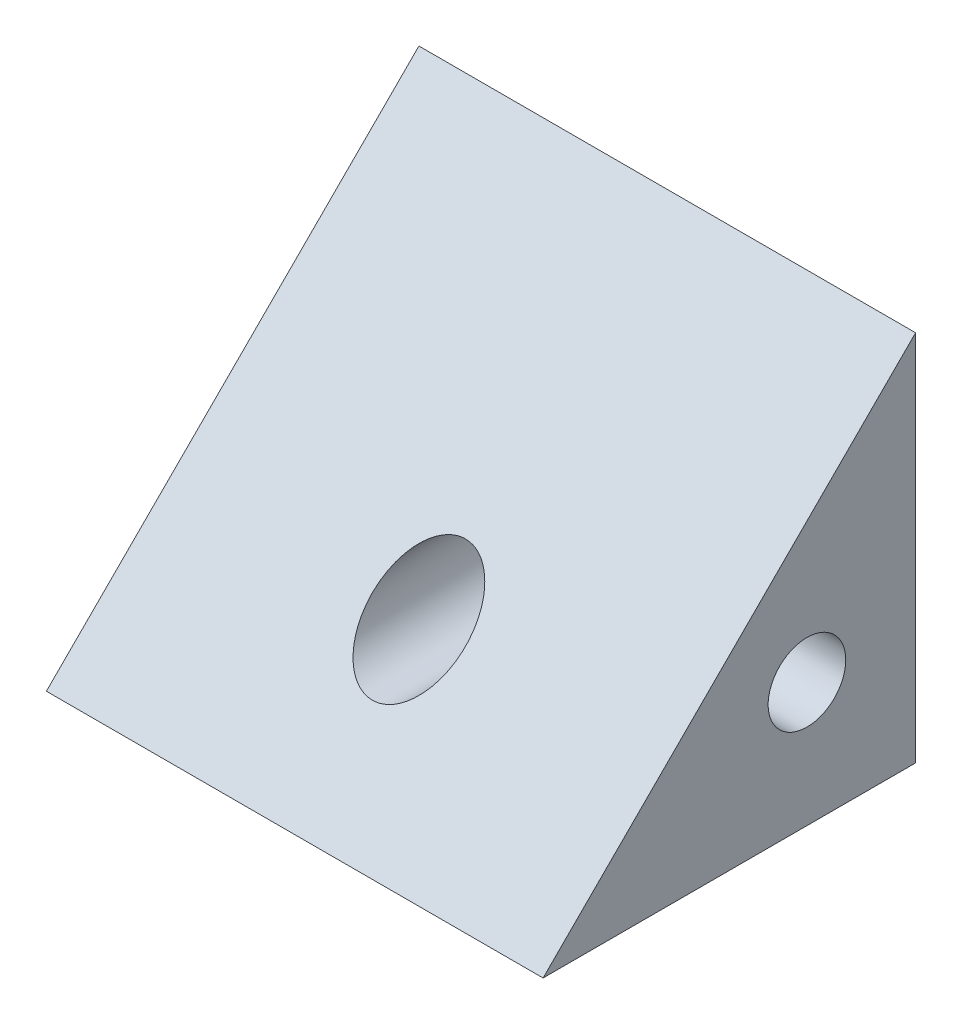
ISO-10303-21;
HEADER;
FILE_DESCRIPTION(('STEP AP214'),'2;1');
FILE_NAME('part.step','',(''),(''),'','','');
FILE_SCHEMA(('AUTOMOTIVE_DESIGN { 1 0 10303 214 1 1 1 1 }'));
ENDSEC;
DATA;
#1=APPLICATION_CONTEXT('core data for automotive mechanical design processes');
#2=APPLICATION_PROTOCOL_DEFINITION('international standard','automotive_design',2000,#1);
#3=PRODUCT_CONTEXT('',#1,'mechanical');
#4=PRODUCT('Part','Part','',(#3));
#5=PRODUCT_RELATED_PRODUCT_CATEGORY('part','',(#4));
#6=PRODUCT_DEFINITION_FORMATION('','',#4);
#7=PRODUCT_DEFINITION_CONTEXT('part definition',#1,'design');
#8=PRODUCT_DEFINITION('design','',#6,#7);
#9=PRODUCT_DEFINITION_SHAPE('','',#8);
#10=(LENGTH_UNIT() NAMED_UNIT(*) SI_UNIT(.MILLI.,.METRE.));
#11=(NAMED_UNIT(*) PLANE_ANGLE_UNIT() SI_UNIT($,.RADIAN.));
#12=(NAMED_UNIT(*) SI_UNIT($,.STERADIAN.) SOLID_ANGLE_UNIT());
#13=UNCERTAINTY_MEASURE_WITH_UNIT(LENGTH_MEASURE(1.E-05),#10,'distance_accuracy_value','');
#14=(GEOMETRIC_REPRESENTATION_CONTEXT(3) GLOBAL_UNCERTAINTY_ASSIGNED_CONTEXT((#13)) GLOBAL_UNIT_ASSIGNED_CONTEXT((#10,
#11,#12)) REPRESENTATION_CONTEXT('',''));
#15=CARTESIAN_POINT('',(0.,0.,0.));
#16=DIRECTION('',(0.,0.,1.));
#17=DIRECTION('',(1.,0.,0.));
#18=AXIS2_PLACEMENT_3D('',#15,#16,#17);
#19=CARTESIAN_POINT('',(0.,0.,14.));
#20=DIRECTION('',(1.,0.,0.));
#21=DIRECTION('',(0.,1.,0.));
#22=AXIS2_PLACEMENT_3D('',#19,#20,#21);
#23=PLANE('',#22);
#24=CARTESIAN_POINT('',(0.,4.,3.5));
#25=DIRECTION('',(1.,0.,0.));
#26=DIRECTION('',(0.,0.,-1.));
#27=AXIS2_PLACEMENT_3D('',#24,#25,#26);
#28=CIRCLE('',#27,1.25);
#29=CARTESIAN_POINT('',(0.,4.,2.25));
#30=VERTEX_POINT('',#29);
#31=EDGE_CURVE('E195',#30,#30,#28,.T.);
#32=ORIENTED_EDGE('',*,*,#31,.T.);
#33=EDGE_LOOP('',(#32));
#34=FACE_BOUND('',#33,.T.);
#35=DIRECTION('',(0.,0.,-1.));
#36=VECTOR('',#35,1.);
#37=CARTESIAN_POINT('',(0.,0.,14.));
#38=LINE('',#37,#36);
#39=CARTESIAN_POINT('',(0.,0.,11.9999999999998));
#40=VERTEX_POINT('',#39);
#41=CARTESIAN_POINT('',(0.,0.,0.));
#42=VERTEX_POINT('',#41);
#43=EDGE_CURVE('E70',#40,#42,#38,.T.);
#44=ORIENTED_EDGE('',*,*,#43,.F.);
#45=DIRECTION('',(0.,-0.707106781186551,0.707106781186544));
#46=VECTOR('',#45,1.);
#47=CARTESIAN_POINT('',(0.,-2.00000000000025,14.));
#48=LINE('',#47,#46);
#49=CARTESIAN_POINT('',(0.,12.,0.));
#50=VERTEX_POINT('',#49);
#51=EDGE_CURVE('E46',#40,#50,#48,.F.);
#52=ORIENTED_EDGE('',*,*,#51,.T.);
#53=DIRECTION('',(0.,-1.,0.));
#54=VECTOR('',#53,1.);
#55=CARTESIAN_POINT('',(0.,0.,0.));
#56=LINE('',#55,#54);
#57=EDGE_CURVE('E84',#50,#42,#56,.T.);
#58=ORIENTED_EDGE('',*,*,#57,.T.);
#59=EDGE_LOOP('',(#44,#52,#58));
#60=FACE_BOUND('',#59,.T.);
#61=ADVANCED_FACE('F33',(#34,#60),#23,.F.);
#62=CARTESIAN_POINT('',(0.,0.,14.));
#63=DIRECTION('',(0.,1.,0.));
#64=DIRECTION('',(0.,0.,1.));
#65=AXIS2_PLACEMENT_3D('',#62,#63,#64);
#66=PLANE('',#65);
#67=DIRECTION('',(0.,0.,-1.));
#68=VECTOR('',#67,1.);
#69=CARTESIAN_POINT('',(16.,0.,14.));
#70=LINE('',#69,#68);
#71=CARTESIAN_POINT('',(16.,0.,11.9999999999998));
#72=VERTEX_POINT('',#71);
#73=CARTESIAN_POINT('',(16.,0.,0.));
#74=VERTEX_POINT('',#73);
#75=EDGE_CURVE('E78',#72,#74,#70,.T.);
#76=ORIENTED_EDGE('',*,*,#75,.F.);
#77=DIRECTION('',(1.,0.,0.));
#78=VECTOR('',#77,1.);
#79=CARTESIAN_POINT('',(0.,0.,11.9999999999998));
#80=LINE('',#79,#78);
#81=EDGE_CURVE('E54',#72,#40,#80,.F.);
#82=ORIENTED_EDGE('',*,*,#81,.T.);
#83=ORIENTED_EDGE('',*,*,#43,.T.);
#84=DIRECTION('',(1.,0.,0.));
#85=VECTOR('',#84,1.);
#86=CARTESIAN_POINT('',(0.,0.,0.));
#87=LINE('',#86,#85);
#88=EDGE_CURVE('E73',#42,#74,#87,.T.);
#89=ORIENTED_EDGE('',*,*,#88,.T.);
#90=EDGE_LOOP('',(#76,#82,#83,#89));
#91=FACE_BOUND('',#90,.T.);
#92=ADVANCED_FACE('F72',(#91),#66,.F.);
#93=CARTESIAN_POINT('',(16.,0.,14.));
#94=DIRECTION('',(-1.,0.,0.));
#95=DIRECTION('',(0.,0.,1.));
#96=AXIS2_PLACEMENT_3D('',#93,#94,#95);
#97=PLANE('',#96);
#98=CARTESIAN_POINT('',(16.,4.,3.5));
#99=DIRECTION('',(1.,0.,0.));
#100=DIRECTION('',(0.,0.,-1.));
#101=AXIS2_PLACEMENT_3D('',#98,#99,#100);
#102=CIRCLE('',#101,1.24999999999999);
#103=CARTESIAN_POINT('',(16.,4.,2.25000000000001));
#104=VERTEX_POINT('',#103);
#105=EDGE_CURVE('E105',#104,#104,#102,.T.);
#106=ORIENTED_EDGE('',*,*,#105,.F.);
#107=EDGE_LOOP('',(#106));
#108=FACE_BOUND('',#107,.T.);
#109=DIRECTION('',(0.,1.,0.));
#110=VECTOR('',#109,1.);
#111=CARTESIAN_POINT('',(16.,0.,0.));
#112=LINE('',#111,#110);
#113=CARTESIAN_POINT('',(16.,12.,0.));
#114=VERTEX_POINT('',#113);
#115=EDGE_CURVE('E86',#74,#114,#112,.T.);
#116=ORIENTED_EDGE('',*,*,#115,.T.);
#117=DIRECTION('',(0.,0.707106781186551,-0.707106781186544));
#118=VECTOR('',#117,1.);
#119=CARTESIAN_POINT('',(16.,-2.00000000000025,14.));
#120=LINE('',#119,#118);
#121=EDGE_CURVE('E11',#114,#72,#120,.F.);
#122=ORIENTED_EDGE('',*,*,#121,.T.);
#123=ORIENTED_EDGE('',*,*,#75,.T.);
#124=EDGE_LOOP('',(#116,#122,#123));
#125=FACE_BOUND('',#124,.T.);
#126=ADVANCED_FACE('F126',(#108,#125),#97,.F.);
#127=CARTESIAN_POINT('',(0.,12.,0.));
#128=DIRECTION('',(0.,0.,-1.));
#129=DIRECTION('',(-1.,0.,0.));
#130=AXIS2_PLACEMENT_3D('',#127,#128,#129);
#131=PLANE('',#130);
#132=CARTESIAN_POINT('',(8.,4.,0.));
#133=DIRECTION('',(0.,0.,-1.));
#134=DIRECTION('',(-1.,0.,0.));
#135=AXIS2_PLACEMENT_3D('',#132,#133,#134);
#136=CIRCLE('',#135,1.5);
#137=CARTESIAN_POINT('',(6.5,4.,0.));
#138=VERTEX_POINT('',#137);
#139=EDGE_CURVE('E91',#138,#138,#136,.T.);
#140=ORIENTED_EDGE('',*,*,#139,.F.);
#141=EDGE_LOOP('',(#140));
#142=FACE_BOUND('',#141,.T.);
#143=ORIENTED_EDGE('',*,*,#57,.F.);
#144=DIRECTION('',(-1.,0.,0.));
#145=VECTOR('',#144,1.);
#146=CARTESIAN_POINT('',(0.,12.,0.));
#147=LINE('',#146,#145);
#148=EDGE_CURVE('E97',#114,#50,#147,.T.);
#149=ORIENTED_EDGE('',*,*,#148,.F.);
#150=ORIENTED_EDGE('',*,*,#115,.F.);
#151=ORIENTED_EDGE('',*,*,#88,.F.);
#152=EDGE_LOOP('',(#143,#149,#150,#151));
#153=FACE_BOUND('',#152,.T.);
#154=ADVANCED_FACE('F82',(#142,#153),#131,.T.);
#155=CARTESIAN_POINT('',(0.,-2.00000000000025,14.));
#156=DIRECTION('',(0.,-0.707106781186544,-0.707106781186551));
#157=DIRECTION('',(0.,0.707106781186551,-0.707106781186544));
#158=AXIS2_PLACEMENT_3D('',#155,#156,#157);
#159=PLANE('',#158);
#160=CARTESIAN_POINT('',(8.,4.,7.99999999999982));
#161=DIRECTION('',(0.,-0.707106781186544,-0.707106781186551));
#162=DIRECTION('',(0.,0.707106781186551,-0.707106781186544));
#163=AXIS2_PLACEMENT_3D('',#160,#161,#162);
#164=ELLIPSE('',#163,2.12132034355963,1.5);
#165=CARTESIAN_POINT('',(8.,5.5,6.49999999999983));
#166=VERTEX_POINT('',#165);
#167=EDGE_CURVE('E88',#166,#166,#164,.F.);
#168=ORIENTED_EDGE('',*,*,#167,.F.);
#169=EDGE_LOOP('',(#168));
#170=FACE_BOUND('',#169,.T.);
#171=ORIENTED_EDGE('',*,*,#121,.F.);
#172=ORIENTED_EDGE('',*,*,#148,.T.);
#173=ORIENTED_EDGE('',*,*,#51,.F.);
#174=ORIENTED_EDGE('',*,*,#81,.F.);
#175=EDGE_LOOP('',(#171,#172,#173,#174));
#176=FACE_BOUND('',#175,.T.);
#177=ADVANCED_FACE('F35',(#170,#176),#159,.F.);
#178=CARTESIAN_POINT('',(8.,4.,11.9999999999998));
#179=DIRECTION('',(0.,0.,-1.));
#180=DIRECTION('',(-1.,0.,0.));
#181=AXIS2_PLACEMENT_3D('',#178,#179,#180);
#182=CYLINDRICAL_SURFACE('',#181,1.5);
#183=CARTESIAN_POINT('',(6.5,4.,4.74999999999999));
#184=CARTESIAN_POINT('',(6.50000239399492,4.0593787688505,4.74999755162013));
#185=CARTESIAN_POINT('',(6.50355666693978,4.11877565707596,4.74573873608632));
#186=CARTESIAN_POINT('',(6.51744616573042,4.23559122971026,4.72901865029432));
#187=CARTESIAN_POINT('',(6.52778641353023,4.29300841589437,4.71655130529971));
#188=CARTESIAN_POINT('',(6.55428662014082,4.40391503473732,4.68434389929648));
#189=CARTESIAN_POINT('',(6.57041178205293,4.45742569749425,4.66464730700095));
#190=CARTESIAN_POINT('',(6.60735385419265,4.55992045809506,4.6189916319036));
#191=CARTESIAN_POINT('',(6.62817234945817,4.6089030188045,4.59303043320278));
#192=CARTESIAN_POINT('',(6.68163039375944,4.7189512027702,4.52527232994862));
#193=CARTESIAN_POINT('',(6.71580315690819,4.77784638468749,4.48116142459714));
#194=CARTESIAN_POINT('',(6.78788095628661,4.88600669034164,4.38474132022427));
#195=CARTESIAN_POINT('',(6.82579623910438,4.9352442077191,4.3324093677746));
#196=CARTESIAN_POINT('',(6.9030045217814,5.02476981505215,4.21947566655175));
#197=CARTESIAN_POINT('',(6.94231003270693,5.06487540714461,4.1587387889954));
#198=CARTESIAN_POINT('',(7.01752662176214,5.13460946975338,4.0296493277532));
#199=CARTESIAN_POINT('',(7.05344743495647,5.16426870455502,3.96131989924883));
#200=CARTESIAN_POINT('',(7.10103329707016,5.20096809386343,3.84915232182338));
#201=CARTESIAN_POINT('',(7.11631654622038,5.21216917699589,3.80823415135927));
#202=CARTESIAN_POINT('',(7.14203599010772,5.23050643018312,3.72405890858106));
#203=CARTESIAN_POINT('',(7.15248393799755,5.23765246650146,3.68080779601689));
#204=CARTESIAN_POINT('',(7.16689486023864,5.24740539483338,3.59211619323376));
#205=CARTESIAN_POINT('',(7.17077739469819,5.24995600781897,3.5466554691685));
#206=CARTESIAN_POINT('',(7.17090850982789,5.25004286433053,3.45571924480199));
#207=CARTESIAN_POINT('',(7.16715699043465,5.24757904212978,3.41024374431485));
#208=CARTESIAN_POINT('',(7.15229211139434,5.23752620102326,3.31723645016103));
#209=CARTESIAN_POINT('',(7.14059168754301,5.22952745139609,3.2698487974024));
#210=CARTESIAN_POINT('',(7.11155746683417,5.20871318849992,3.1778988541605));
#211=CARTESIAN_POINT('',(7.09420500254403,5.19588169148343,3.13334651912333));
#212=CARTESIAN_POINT('',(7.04486086529174,5.15722563130128,3.02189560230472));
#213=CARTESIAN_POINT('',(7.01026545825773,5.1281992385967,2.95728511979403));
#214=CARTESIAN_POINT('',(6.93823637303839,5.06071724104507,2.83497126098836));
#215=CARTESIAN_POINT('',(6.9007977059845,5.02224478491079,2.77728050595929));
#216=CARTESIAN_POINT('',(6.82461504011128,4.93383855425783,2.66587958721672));
#217=CARTESIAN_POINT('',(6.78590489007201,4.88341140823602,2.61253430361172));
#218=CARTESIAN_POINT('',(6.71245088504168,4.77241956504069,2.5144403695611));
#219=CARTESIAN_POINT('',(6.67769854291225,4.71187727442858,2.46967317783161));
#220=CARTESIAN_POINT('',(6.62285610617041,4.59705631416899,2.4002931891689));
#221=CARTESIAN_POINT('',(6.60125843106811,4.54486377253069,2.37342871405698));
#222=CARTESIAN_POINT('',(6.56346079857642,4.43553561724092,2.3268284643236));
#223=CARTESIAN_POINT('',(6.54725747258112,4.37840311663205,2.30708824017554));
#224=CARTESIAN_POINT('',(6.52145087815961,4.25997718059177,2.27579141940212));
#225=CARTESIAN_POINT('',(6.5118986098353,4.19865546832503,2.26429803928538));
#226=CARTESIAN_POINT('',(6.50054281275041,4.074279981704,2.25064537143071));
#227=CARTESIAN_POINT('',(6.49873409950092,4.01122739468353,2.24847983847781));
#228=CARTESIAN_POINT('',(6.50277501270704,3.89334489770011,2.25333122508869));
#229=CARTESIAN_POINT('',(6.5077332648208,3.83843471467585,2.25927932977239));
#230=CARTESIAN_POINT('',(6.52337203429476,3.73067753270769,2.2781334646897));
#231=CARTESIAN_POINT('',(6.53405323806802,3.67783078206858,2.29104032956088));
#232=CARTESIAN_POINT('',(6.56055245886816,3.57471719257196,2.3233117345129));
#233=CARTESIAN_POINT('',(6.57643742482087,3.52449444133452,2.34276053215235));
#234=CARTESIAN_POINT('',(6.61231912695755,3.42817071314382,2.38719767868729));
#235=CARTESIAN_POINT('',(6.63231738286274,3.38207126867119,2.41218807528312));
#236=CARTESIAN_POINT('',(6.68512558852998,3.27466162330817,2.47921664146491));
#237=CARTESIAN_POINT('',(6.71965486478461,3.21582288883024,2.52386964637634));
#238=CARTESIAN_POINT('',(6.79238166787316,3.10786035648352,2.62141682602767));
#239=CARTESIAN_POINT('',(6.83059039684529,3.05876771458124,2.67433649377557));
#240=CARTESIAN_POINT('',(6.90823568684893,2.96966098700137,2.78848795246967));
#241=CARTESIAN_POINT('',(6.94768196888398,2.92982624669905,2.84985223063406));
#242=CARTESIAN_POINT('',(7.02289413967484,2.86077589464988,2.98029258014808));
#243=CARTESIAN_POINT('',(7.05867178274804,2.83152555671621,3.04934244271885));
#244=CARTESIAN_POINT('',(7.10536481112295,2.79581286037406,3.16214898470547));
#245=CARTESIAN_POINT('',(7.12014446495473,2.78505833548114,3.20292093843129));
#246=CARTESIAN_POINT('',(7.14478665170649,2.76758881424494,3.28672227341193));
#247=CARTESIAN_POINT('',(7.15466145391227,2.76086372963006,3.32974572127118));
#248=CARTESIAN_POINT('',(7.16792290420274,2.75191353391774,3.41781988033101));
#249=CARTESIAN_POINT('',(7.1712336860096,2.74974102486855,3.46288820694847));
#250=CARTESIAN_POINT('',(7.17037851561059,2.75030899368391,3.55292606417596));
#251=CARTESIAN_POINT('',(7.16621059190389,2.75305076702805,3.59789556560518));
#252=CARTESIAN_POINT('',(7.15053581734841,2.76367379318166,3.69083749596599));
#253=CARTESIAN_POINT('',(7.13829452719416,2.7720713854345,3.73861956187496));
#254=CARTESIAN_POINT('',(7.10820497290156,2.79374785194544,3.83126120670841));
#255=CARTESIAN_POINT('',(7.09033819356937,2.80704287003597,3.87611053579845));
#256=CARTESIAN_POINT('',(7.03970661892041,2.8470094596258,3.98834179815002));
#257=CARTESIAN_POINT('',(7.00437642970173,2.87694332515928,4.05338132903312));
#258=CARTESIAN_POINT('',(6.93106891848429,2.94645055904937,4.17640963589643));
#259=CARTESIAN_POINT('',(6.8930870252134,2.98604088244111,4.2343857382866));
#260=CARTESIAN_POINT('',(6.81615174472753,3.07684231648868,4.34599075337965));
#261=CARTESIAN_POINT('',(6.7772419402404,3.12852776516614,4.39926748450177));
#262=CARTESIAN_POINT('',(6.7037136042539,3.24223465672031,4.49693530462561));
#263=CARTESIAN_POINT('',(6.66908563772856,3.30423264191934,4.54134606754817));
#264=CARTESIAN_POINT('',(6.61528913772972,3.42072199411897,4.60915651690691));
#265=CARTESIAN_POINT('',(6.59443930747219,3.47300049985876,4.63501910031226));
#266=CARTESIAN_POINT('',(6.55819251939872,3.58228021722789,4.67960948970955));
#267=CARTESIAN_POINT('',(6.54278829963344,3.63927501328314,4.69834680009581));
#268=CARTESIAN_POINT('',(6.52070630677557,3.74668995843581,4.72509419634338));
#269=CARTESIAN_POINT('',(6.51298929880184,3.79657726057497,4.73438755201361));
#270=CARTESIAN_POINT('',(6.50263537523668,3.89763864221647,4.74684119321787));
#271=CARTESIAN_POINT('',(6.49999793625895,3.94881258859565,4.75000211062353));
#272=CARTESIAN_POINT('',(6.5,4.,4.74999999999999));
#273=B_SPLINE_CURVE_WITH_KNOTS('',3,(#183,#184,#185,#186,#187,#188,#189,#190,#191,#192,#193,
#194,#195,#196,#197,#198,#199,#200,#201,#202,#203,#204,#205,#206,#207,#208,#209,#210,#211,#212,
#213,#214,#215,#216,#217,#218,#219,#220,#221,#222,#223,#224,#225,#226,#227,#228,#229,#230,#231,
#232,#233,#234,#235,#236,#237,#238,#239,#240,#241,#242,#243,#244,#245,#246,#247,#248,#249,#250,
#251,#252,#253,#254,#255,#256,#257,#258,#259,#260,#261,#262,#263,#264,#265,#266,#267,#268,#269,
#270,#271,#272),.UNSPECIFIED.,.T.,.F.,(4,2,2,2,2,2,2,2,2,2,2,2,2,2,2,2,2,2,2,2,2,2,2,2,2,2,2,2,
2,2,2,2,2,2,2,2,2,2,2,2,2,2,2,2,4),(0.,0.177920638407555,0.355973095513479,0.53297202679775,
0.710030824150575,0.952125893800627,1.19490321558387,1.4421737640865,1.68870989486939,
1.82361318167479,1.95818681458037,2.09439761612089,2.23061020305626,2.37816635242836,
2.52621487430063,2.76143398970636,2.99707581215809,3.24501566810455,3.49241341014752,
3.67933989515106,3.86614943036556,4.05437609196179,4.24247671173498,4.40804641875281,
4.57363598871254,4.74144560410121,4.90931733118535,5.15261089108598,5.39667010414654,
5.64512295341125,5.89275310452976,6.02641745468301,6.1597457435646,6.29460624678871,
6.42950230652133,6.57876724728637,6.72852869227184,6.96677041328344,7.20543349464892,
7.45579032127002,7.70558526561251,7.89070171070693,8.07557035570182,8.22896247938914,
8.38233879708314),.UNSPECIFIED.);
#274=CARTESIAN_POINT('',(6.5,4.,4.74999999999999));
#275=VERTEX_POINT('',#274);
#276=EDGE_CURVE('E37',#275,#275,#273,.T.);
#277=ORIENTED_EDGE('',*,*,#276,.T.);
#278=EDGE_LOOP('',(#277));
#279=FACE_BOUND('',#278,.T.);
#280=CARTESIAN_POINT('',(9.5,4.,2.25000000000001));
#281=CARTESIAN_POINT('',(9.49999760600508,4.0593787688505,2.25000244837987));
#282=CARTESIAN_POINT('',(9.49644333306022,4.11877565707596,2.25426126391368));
#283=CARTESIAN_POINT('',(9.48255383426958,4.23559122971026,2.27098134970568));
#284=CARTESIAN_POINT('',(9.47221358646978,4.29300841589437,2.28344869470029));
#285=CARTESIAN_POINT('',(9.44571337985919,4.40391503473732,2.31565610070352));
#286=CARTESIAN_POINT('',(9.42958821794707,4.45742569749425,2.33535269299905));
#287=CARTESIAN_POINT('',(9.39264614580735,4.55992045809506,2.3810083680964));
#288=CARTESIAN_POINT('',(9.37182765054183,4.6089030188045,2.40696956679722));
#289=CARTESIAN_POINT('',(9.31836960624056,4.7189512027702,2.47472767005138));
#290=CARTESIAN_POINT('',(9.28419684309181,4.77784638468749,2.51883857540286));
#291=CARTESIAN_POINT('',(9.21211904371339,4.88600669034164,2.61525867977573));
#292=CARTESIAN_POINT('',(9.17420376089562,4.9352442077191,2.6675906322254));
#293=CARTESIAN_POINT('',(9.0969954782186,5.02476981505215,2.78052433344825));
#294=CARTESIAN_POINT('',(9.05768996729307,5.06487540714461,2.8412612110046));
#295=CARTESIAN_POINT('',(8.98247337823787,5.13460946975338,2.9703506722468));
#296=CARTESIAN_POINT('',(8.94655256504353,5.16426870455502,3.03868010075117));
#297=CARTESIAN_POINT('',(8.89896670292984,5.20096809386343,3.15084767817662));
#298=CARTESIAN_POINT('',(8.88368345377962,5.21216917699589,3.19176584864073));
#299=CARTESIAN_POINT('',(8.85796400989228,5.23050643018312,3.27594109141894));
#300=CARTESIAN_POINT('',(8.84751606200246,5.23765246650146,3.31919220398311));
#301=CARTESIAN_POINT('',(8.83310513976136,5.24740539483338,3.40788380676624));
#302=CARTESIAN_POINT('',(8.82922260530181,5.24995600781897,3.45334453083149));
#303=CARTESIAN_POINT('',(8.82909149017212,5.25004286433053,3.54428075519801));
#304=CARTESIAN_POINT('',(8.83284300956535,5.24757904212978,3.58975625568515));
#305=CARTESIAN_POINT('',(8.84770788860567,5.23752620102326,3.68276354983897));
#306=CARTESIAN_POINT('',(8.85940831245699,5.22952745139609,3.7301512025976));
#307=CARTESIAN_POINT('',(8.88844253316583,5.20871318849992,3.8221011458395));
#308=CARTESIAN_POINT('',(8.90579499745598,5.19588169148343,3.86665348087667));
#309=CARTESIAN_POINT('',(8.95513913470827,5.15722563130128,3.97810439769529));
#310=CARTESIAN_POINT('',(8.98973454174227,5.1281992385967,4.04271488020597));
#311=CARTESIAN_POINT('',(9.06176362696161,5.06071724104507,4.16502873901165));
#312=CARTESIAN_POINT('',(9.09920229401551,5.02224478491079,4.22271949404071));
#313=CARTESIAN_POINT('',(9.17538495988872,4.93383855425782,4.33412041278328));
#314=CARTESIAN_POINT('',(9.214095109928,4.88341140823602,4.38746569638829));
#315=CARTESIAN_POINT('',(9.28754911495833,4.77241956504068,4.48555963043891));
#316=CARTESIAN_POINT('',(9.32230145708775,4.71187727442857,4.53032682216839));
#317=CARTESIAN_POINT('',(9.3771438938296,4.59705631416898,4.5997068108311));
#318=CARTESIAN_POINT('',(9.3987415689319,4.54486377253069,4.62657128594302));
#319=CARTESIAN_POINT('',(9.43653920142359,4.43553561724091,4.6731715356764));
#320=CARTESIAN_POINT('',(9.45274252741888,4.37840311663204,4.69291175982446));
#321=CARTESIAN_POINT('',(9.47854912184039,4.25997718059176,4.72420858059788));
#322=CARTESIAN_POINT('',(9.48810139016471,4.19865546832502,4.73570196071462));
#323=CARTESIAN_POINT('',(9.4994571872496,4.07427998170398,4.74935462856929));
#324=CARTESIAN_POINT('',(9.50126590049908,4.01122739468352,4.75152016152219));
#325=CARTESIAN_POINT('',(9.49722498729296,3.8933448977001,4.74666877491131));
#326=CARTESIAN_POINT('',(9.49226673517921,3.83843471467584,4.74072067022761));
#327=CARTESIAN_POINT('',(9.47662796570524,3.73067753270768,4.72186653531029));
#328=CARTESIAN_POINT('',(9.46594676193198,3.67783078206857,4.70895967043912));
#329=CARTESIAN_POINT('',(9.43944754113184,3.57471719257195,4.67668826548709));
#330=CARTESIAN_POINT('',(9.42356257517913,3.52449444133451,4.65723946784765));
#331=CARTESIAN_POINT('',(9.38768087304245,3.42817071314381,4.6128023213127));
#332=CARTESIAN_POINT('',(9.36768261713727,3.38207126867119,4.58781192471688));
#333=CARTESIAN_POINT('',(9.31487441147003,3.27466162330817,4.52078335853508));
#334=CARTESIAN_POINT('',(9.28034513521539,3.21582288883024,4.47613035362366));
#335=CARTESIAN_POINT('',(9.20761833212684,3.10786035648351,4.37858317397232));
#336=CARTESIAN_POINT('',(9.16940960315471,3.05876771458123,4.32566350622442));
#337=CARTESIAN_POINT('',(9.09176431315106,2.96966098700137,4.21151204753032));
#338=CARTESIAN_POINT('',(9.05231803111602,2.92982624669904,4.15014776936593));
#339=CARTESIAN_POINT('',(8.97710586032516,2.86077589464987,4.01970741985191));
#340=CARTESIAN_POINT('',(8.94132821725196,2.8315255567162,3.95065755728114));
#341=CARTESIAN_POINT('',(8.89463518887705,2.79581286037406,3.83785101529452));
#342=CARTESIAN_POINT('',(8.87985553504527,2.78505833548114,3.79707906156869));
#343=CARTESIAN_POINT('',(8.85521334829352,2.76758881424494,3.71327772658806));
#344=CARTESIAN_POINT('',(8.84533854608773,2.76086372963006,3.67025427872881));
#345=CARTESIAN_POINT('',(8.83207709579727,2.75191353391774,3.58218011966898));
#346=CARTESIAN_POINT('',(8.82876631399041,2.74974102486854,3.53711179305152));
#347=CARTESIAN_POINT('',(8.82962148438942,2.75030899368391,3.44707393582403));
#348=CARTESIAN_POINT('',(8.83378940809612,2.75305076702805,3.40210443439481));
#349=CARTESIAN_POINT('',(8.84946418265159,2.76367379318166,3.30916250403401));
#350=CARTESIAN_POINT('',(8.86170547280585,2.7720713854345,3.26138043812503));
#351=CARTESIAN_POINT('',(8.89179502709844,2.79374785194544,3.16873879329158));
#352=CARTESIAN_POINT('',(8.90966180643064,2.80704287003597,3.12388946420154));
#353=CARTESIAN_POINT('',(8.96029338107959,2.8470094596258,3.01165820184997));
#354=CARTESIAN_POINT('',(8.99562357029828,2.87694332515928,2.94661867096688));
#355=CARTESIAN_POINT('',(9.06893108151572,2.94645055904937,2.82359036410357));
#356=CARTESIAN_POINT('',(9.1069129747866,2.98604088244111,2.76561426171339));
#357=CARTESIAN_POINT('',(9.18384825527248,3.07684231648869,2.65400924662034));
#358=CARTESIAN_POINT('',(9.22275805975961,3.12852776516614,2.60073251549823));
#359=CARTESIAN_POINT('',(9.29628639574611,3.24223465672031,2.50306469537438));
#360=CARTESIAN_POINT('',(9.33091436227144,3.30423264191934,2.45865393245183));
#361=CARTESIAN_POINT('',(9.38471086227028,3.42072199411898,2.39084348309308));
#362=CARTESIAN_POINT('',(9.40556069252781,3.47300049985877,2.36498089968773));
#363=CARTESIAN_POINT('',(9.44180748060128,3.5822802172279,2.32039051029044));
#364=CARTESIAN_POINT('',(9.45721170036656,3.63927501328315,2.30165319990419));
#365=CARTESIAN_POINT('',(9.47929369322443,3.74668995843582,2.27490580365662));
#366=CARTESIAN_POINT('',(9.48701070119817,3.79657726057497,2.26561244798639));
#367=CARTESIAN_POINT('',(9.49736462476332,3.89763864221648,2.25315880678213));
#368=CARTESIAN_POINT('',(9.50000206374105,3.94881258859565,2.24999788937647));
#369=CARTESIAN_POINT('',(9.5,4.,2.25000000000001));
#370=B_SPLINE_CURVE_WITH_KNOTS('',3,(#280,#281,#282,#283,#284,#285,#286,#287,#288,#289,#290,
#291,#292,#293,#294,#295,#296,#297,#298,#299,#300,#301,#302,#303,#304,#305,#306,#307,#308,#309,
#310,#311,#312,#313,#314,#315,#316,#317,#318,#319,#320,#321,#322,#323,#324,#325,#326,#327,#328,
#329,#330,#331,#332,#333,#334,#335,#336,#337,#338,#339,#340,#341,#342,#343,#344,#345,#346,#347,
#348,#349,#350,#351,#352,#353,#354,#355,#356,#357,#358,#359,#360,#361,#362,#363,#364,#365,#366,
#367,#368,#369),.UNSPECIFIED.,.T.,.F.,(4,2,2,2,2,2,2,2,2,2,2,2,2,2,2,2,2,2,2,2,2,2,2,2,2,2,2,2,
2,2,2,2,2,2,2,2,2,2,2,2,2,2,2,2,4),(0.,0.177920638407557,0.355973095513479,0.532972026797751,
0.710030824150575,0.952125893800627,1.19490321558387,1.4421737640865,1.68870989486939,
1.82361318167479,1.95818681458037,2.09439761612089,2.23061020305626,2.37816635242836,
2.52621487430063,2.76143398970636,2.9970758121581,3.24501566810456,3.49241341014753,
3.67933989515107,3.86614943036557,4.0543760919618,4.24247671173499,4.40804641875282,
4.57363598871254,4.74144560410122,4.90931733118535,5.15261089108599,5.39667010414655,
5.64512295341126,5.89275310452977,6.02641745468303,6.15974574356461,6.29460624678871,
6.42950230652134,6.57876724728638,6.72852869227185,6.96677041328345,7.20543349464892,
7.45579032127002,7.70558526561251,7.89070171070693,8.07557035570182,8.22896247938914,
8.38233879708314),.UNSPECIFIED.);
#371=CARTESIAN_POINT('',(9.5,4.,2.25000000000001));
#372=VERTEX_POINT('',#371);
#373=EDGE_CURVE('E101',#372,#372,#370,.T.);
#374=ORIENTED_EDGE('',*,*,#373,.T.);
#375=EDGE_LOOP('',(#374));
#376=FACE_BOUND('',#375,.T.);
#377=ORIENTED_EDGE('',*,*,#167,.T.);
#378=EDGE_LOOP('',(#377));
#379=FACE_BOUND('',#378,.T.);
#380=ORIENTED_EDGE('',*,*,#139,.T.);
#381=EDGE_LOOP('',(#380));
#382=FACE_BOUND('',#381,.T.);
#383=ADVANCED_FACE('F106',(#279,#376,#379,#382),#182,.F.);
#384=CARTESIAN_POINT('',(16.,4.,3.5));
#385=DIRECTION('',(1.,0.,0.));
#386=DIRECTION('',(0.,0.,-1.));
#387=AXIS2_PLACEMENT_3D('',#384,#385,#386);
#388=CYLINDRICAL_SURFACE('',#387,1.24999999999999);
#389=ORIENTED_EDGE('',*,*,#105,.T.);
#390=EDGE_LOOP('',(#389));
#391=FACE_BOUND('',#390,.T.);
#392=ORIENTED_EDGE('',*,*,#373,.F.);
#393=EDGE_LOOP('',(#392));
#394=FACE_BOUND('',#393,.T.);
#395=ADVANCED_FACE('F112',(#391,#394),#388,.F.);
#396=ORIENTED_EDGE('',*,*,#31,.F.);
#397=EDGE_LOOP('',(#396));
#398=FACE_BOUND('',#397,.T.);
#399=ORIENTED_EDGE('',*,*,#276,.F.);
#400=EDGE_LOOP('',(#399));
#401=FACE_BOUND('',#400,.T.);
#402=ADVANCED_FACE('F109',(#398,#401),#388,.F.);
#403=CLOSED_SHELL('',(#61,#92,#126,#154,#177,#383,#395,#402));
#404=MANIFOLD_SOLID_BREP('B2',#403);
#405=ADVANCED_BREP_SHAPE_REPRESENTATION('',(#18,#404),#14);
#406=SHAPE_DEFINITION_REPRESENTATION(#9,#405);
ENDSEC;
END-ISO-10303-21;
